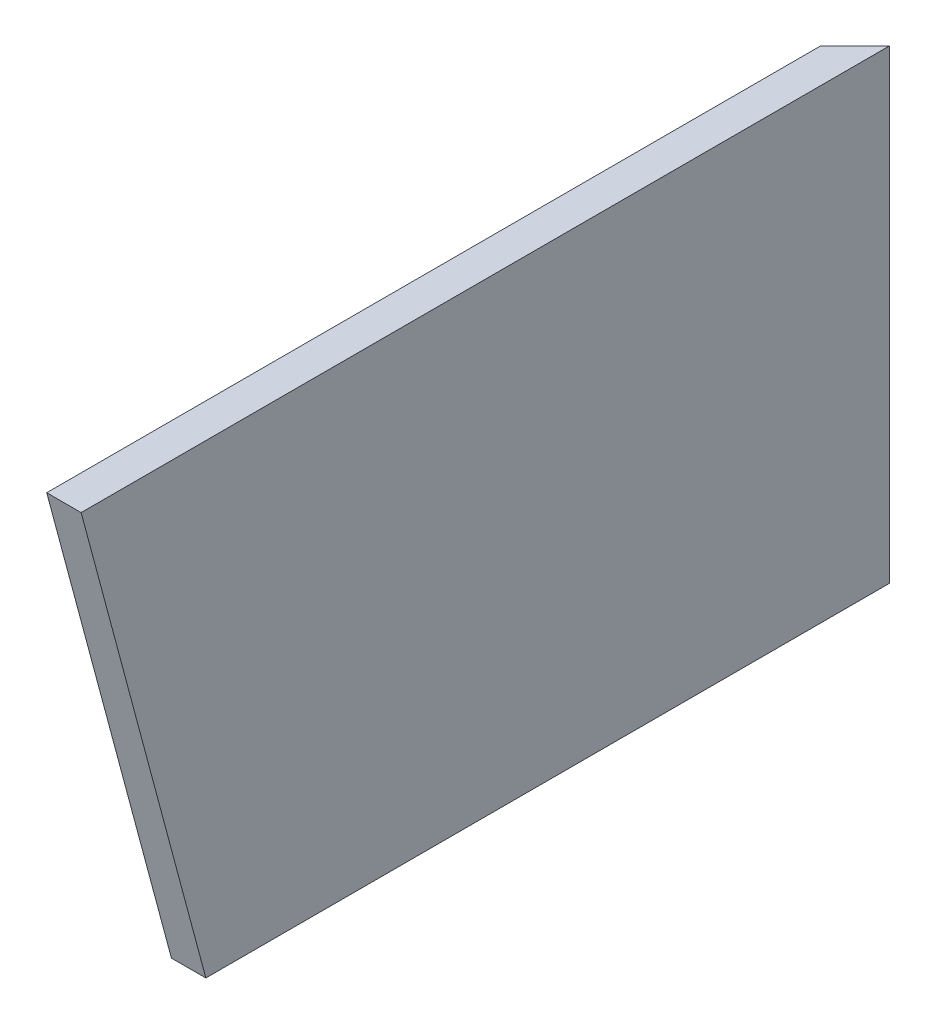
ISO-10303-21;
HEADER;
FILE_DESCRIPTION(('STEP AP214'),'2;1');
FILE_NAME('part.step','',(''),(''),'','','');
FILE_SCHEMA(('AUTOMOTIVE_DESIGN { 1 0 10303 214 1 1 1 1 }'));
ENDSEC;
DATA;
#1=APPLICATION_CONTEXT('core data for automotive mechanical design processes');
#2=APPLICATION_PROTOCOL_DEFINITION('international standard','automotive_design',2000,#1);
#3=PRODUCT_CONTEXT('',#1,'mechanical');
#4=PRODUCT('Part','Part','',(#3));
#5=PRODUCT_RELATED_PRODUCT_CATEGORY('part','',(#4));
#6=PRODUCT_DEFINITION_FORMATION('','',#4);
#7=PRODUCT_DEFINITION_CONTEXT('part definition',#1,'design');
#8=PRODUCT_DEFINITION('design','',#6,#7);
#9=PRODUCT_DEFINITION_SHAPE('','',#8);
#10=(LENGTH_UNIT() NAMED_UNIT(*) SI_UNIT(.MILLI.,.METRE.));
#11=(NAMED_UNIT(*) PLANE_ANGLE_UNIT() SI_UNIT($,.RADIAN.));
#12=(NAMED_UNIT(*) SI_UNIT($,.STERADIAN.) SOLID_ANGLE_UNIT());
#13=UNCERTAINTY_MEASURE_WITH_UNIT(LENGTH_MEASURE(1.E-05),#10,'distance_accuracy_value','');
#14=(GEOMETRIC_REPRESENTATION_CONTEXT(3) GLOBAL_UNCERTAINTY_ASSIGNED_CONTEXT((#13)) GLOBAL_UNIT_ASSIGNED_CONTEXT((#10,
#11,#12)) REPRESENTATION_CONTEXT('',''));
#15=CARTESIAN_POINT('',(0.,0.,0.));
#16=DIRECTION('',(0.,0.,1.));
#17=DIRECTION('',(1.,0.,0.));
#18=AXIS2_PLACEMENT_3D('',#15,#16,#17);
#19=CARTESIAN_POINT('',(-12.7000000000013,171.7294,381.));
#20=DIRECTION('',(1.,0.,0.));
#21=DIRECTION('',(0.,1.,0.));
#22=AXIS2_PLACEMENT_3D('',#19,#20,#21);
#23=PLANE('',#22);
#24=DIRECTION('',(0.,0.,-1.));
#25=VECTOR('',#24,1.);
#26=CARTESIAN_POINT('',(-12.7000000000013,171.7294,381.));
#27=LINE('',#26,#25);
#28=CARTESIAN_POINT('',(-12.7000000000025,171.7294,298.185954046681));
#29=VERTEX_POINT('',#28);
#30=CARTESIAN_POINT('',(-12.7000000000025,171.7294,12.7000000000028));
#31=VERTEX_POINT('',#30);
#32=EDGE_CURVE('E93',#29,#31,#27,.T.);
#33=ORIENTED_EDGE('',*,*,#32,.T.);
#34=DIRECTION('',(0.,1.,0.));
#35=VECTOR('',#34,1.);
#36=CARTESIAN_POINT('',(-12.7000000000025,0.,12.7000000000028));
#37=LINE('',#36,#35);
#38=CARTESIAN_POINT('',(-12.7000000000025,0.,12.7000000000028));
#39=VERTEX_POINT('',#38);
#40=EDGE_CURVE('E80',#39,#31,#37,.T.);
#41=ORIENTED_EDGE('',*,*,#40,.F.);
#42=DIRECTION('',(0.,0.,-1.));
#43=VECTOR('',#42,1.);
#44=CARTESIAN_POINT('',(-12.7,0.,381.));
#45=LINE('',#44,#43);
#46=CARTESIAN_POINT('',(-12.7000000000013,0.,252.1712));
#47=VERTEX_POINT('',#46);
#48=EDGE_CURVE('E11',#47,#39,#45,.T.);
#49=ORIENTED_EDGE('',*,*,#48,.F.);
#50=DIRECTION('',(0.,0.965925826289068,0.258819045102522));
#51=VECTOR('',#50,1.);
#52=CARTESIAN_POINT('',(-12.7000000000013,0.,252.1712));
#53=LINE('',#52,#51);
#54=EDGE_CURVE('E101',#47,#29,#53,.T.);
#55=ORIENTED_EDGE('',*,*,#54,.T.);
#56=EDGE_LOOP('',(#33,#41,#49,#55));
#57=FACE_BOUND('',#56,.T.);
#58=ADVANCED_FACE('F38',(#57),#23,.F.);
#59=CARTESIAN_POINT('',(-12.7,0.,381.));
#60=DIRECTION('',(0.,1.,0.));
#61=DIRECTION('',(0.,0.,1.));
#62=AXIS2_PLACEMENT_3D('',#59,#60,#61);
#63=PLANE('',#62);
#64=ORIENTED_EDGE('',*,*,#48,.T.);
#65=DIRECTION('',(0.707106781186538,0.,-0.707106781186557));
#66=VECTOR('',#65,1.);
#67=CARTESIAN_POINT('',(0.,0.,0.));
#68=LINE('',#67,#66);
#69=CARTESIAN_POINT('',(0.,0.,0.));
#70=VERTEX_POINT('',#69);
#71=EDGE_CURVE('E77',#39,#70,#68,.T.);
#72=ORIENTED_EDGE('',*,*,#71,.T.);
#73=DIRECTION('',(0.,0.,-1.));
#74=VECTOR('',#73,1.);
#75=CARTESIAN_POINT('',(0.,0.,381.));
#76=LINE('',#75,#74);
#77=CARTESIAN_POINT('',(0.,0.,252.1712));
#78=VERTEX_POINT('',#77);
#79=EDGE_CURVE('E46',#78,#70,#76,.T.);
#80=ORIENTED_EDGE('',*,*,#79,.F.);
#81=DIRECTION('',(1.,0.,0.));
#82=VECTOR('',#81,1.);
#83=CARTESIAN_POINT('',(-12.7000000000013,0.,252.1712));
#84=LINE('',#83,#82);
#85=EDGE_CURVE('E98',#47,#78,#84,.T.);
#86=ORIENTED_EDGE('',*,*,#85,.F.);
#87=EDGE_LOOP('',(#64,#72,#80,#86));
#88=FACE_BOUND('',#87,.T.);
#89=ADVANCED_FACE('F97',(#88),#63,.F.);
#90=CARTESIAN_POINT('',(0.,0.,381.));
#91=DIRECTION('',(-1.,0.,0.));
#92=DIRECTION('',(0.,-1.,0.));
#93=AXIS2_PLACEMENT_3D('',#90,#91,#92);
#94=PLANE('',#93);
#95=DIRECTION('',(0.,0.,-1.));
#96=VECTOR('',#95,1.);
#97=CARTESIAN_POINT('',(-1.2622723488703E-12,171.7294,381.));
#98=LINE('',#97,#96);
#99=CARTESIAN_POINT('',(-1.2622723488703E-12,171.7294,298.185954046681));
#100=VERTEX_POINT('',#99);
#101=CARTESIAN_POINT('',(-1.2622723488703E-12,171.7294,0.));
#102=VERTEX_POINT('',#101);
#103=EDGE_CURVE('E113',#100,#102,#98,.T.);
#104=ORIENTED_EDGE('',*,*,#103,.F.);
#105=DIRECTION('',(0.,0.965925826289068,0.258819045102522));
#106=VECTOR('',#105,1.);
#107=CARTESIAN_POINT('',(0.,0.,252.1712));
#108=LINE('',#107,#106);
#109=EDGE_CURVE('E53',#78,#100,#108,.T.);
#110=ORIENTED_EDGE('',*,*,#109,.F.);
#111=ORIENTED_EDGE('',*,*,#79,.T.);
#112=DIRECTION('',(0.,1.,0.));
#113=VECTOR('',#112,1.);
#114=CARTESIAN_POINT('',(0.,0.,0.));
#115=LINE('',#114,#113);
#116=EDGE_CURVE('E82',#70,#102,#115,.T.);
#117=ORIENTED_EDGE('',*,*,#116,.T.);
#118=EDGE_LOOP('',(#104,#110,#111,#117));
#119=FACE_BOUND('',#118,.T.);
#120=ADVANCED_FACE('F118',(#119),#94,.F.);
#121=CARTESIAN_POINT('',(-1.2622723488703E-12,171.7294,381.));
#122=DIRECTION('',(0.,-1.,0.));
#123=DIRECTION('',(0.,0.,-1.));
#124=AXIS2_PLACEMENT_3D('',#121,#122,#123);
#125=PLANE('',#124);
#126=ORIENTED_EDGE('',*,*,#103,.T.);
#127=DIRECTION('',(0.707106781186538,0.,-0.707106781186557));
#128=VECTOR('',#127,1.);
#129=CARTESIAN_POINT('',(0.,171.7294,0.));
#130=LINE('',#129,#128);
#131=EDGE_CURVE('E61',#31,#102,#130,.T.);
#132=ORIENTED_EDGE('',*,*,#131,.F.);
#133=ORIENTED_EDGE('',*,*,#32,.F.);
#134=DIRECTION('',(1.,0.,0.));
#135=VECTOR('',#134,1.);
#136=CARTESIAN_POINT('',(-12.7000000000025,171.7294,298.185954046681));
#137=LINE('',#136,#135);
#138=EDGE_CURVE('E100',#29,#100,#137,.T.);
#139=ORIENTED_EDGE('',*,*,#138,.T.);
#140=EDGE_LOOP('',(#126,#132,#133,#139));
#141=FACE_BOUND('',#140,.T.);
#142=ADVANCED_FACE('F123',(#141),#125,.F.);
#143=CARTESIAN_POINT('',(-12.7000000000013,0.,252.1712));
#144=DIRECTION('',(0.,0.258819045102522,-0.965925826289068));
#145=DIRECTION('',(0.,0.965925826289068,0.258819045102522));
#146=AXIS2_PLACEMENT_3D('',#143,#144,#145);
#147=PLANE('',#146);
#148=ORIENTED_EDGE('',*,*,#109,.T.);
#149=ORIENTED_EDGE('',*,*,#138,.F.);
#150=ORIENTED_EDGE('',*,*,#54,.F.);
#151=ORIENTED_EDGE('',*,*,#85,.T.);
#152=EDGE_LOOP('',(#148,#149,#150,#151));
#153=FACE_BOUND('',#152,.T.);
#154=ADVANCED_FACE('F124',(#153),#147,.F.);
#155=CARTESIAN_POINT('',(0.,0.,0.));
#156=DIRECTION('',(0.707106781186557,0.,0.707106781186538));
#157=DIRECTION('',(0.707106781186538,0.,-0.707106781186557));
#158=AXIS2_PLACEMENT_3D('',#155,#156,#157);
#159=PLANE('',#158);
#160=ORIENTED_EDGE('',*,*,#131,.T.);
#161=ORIENTED_EDGE('',*,*,#116,.F.);
#162=ORIENTED_EDGE('',*,*,#71,.F.);
#163=ORIENTED_EDGE('',*,*,#40,.T.);
#164=EDGE_LOOP('',(#160,#161,#162,#163));
#165=FACE_BOUND('',#164,.T.);
#166=ADVANCED_FACE('F79',(#165),#159,.F.);
#167=CLOSED_SHELL('',(#58,#89,#120,#142,#154,#166));
#168=MANIFOLD_SOLID_BREP('B2',#167);
#169=ADVANCED_BREP_SHAPE_REPRESENTATION('',(#18,#168),#14);
#170=SHAPE_DEFINITION_REPRESENTATION(#9,#169);
ENDSEC;
END-ISO-10303-21;
